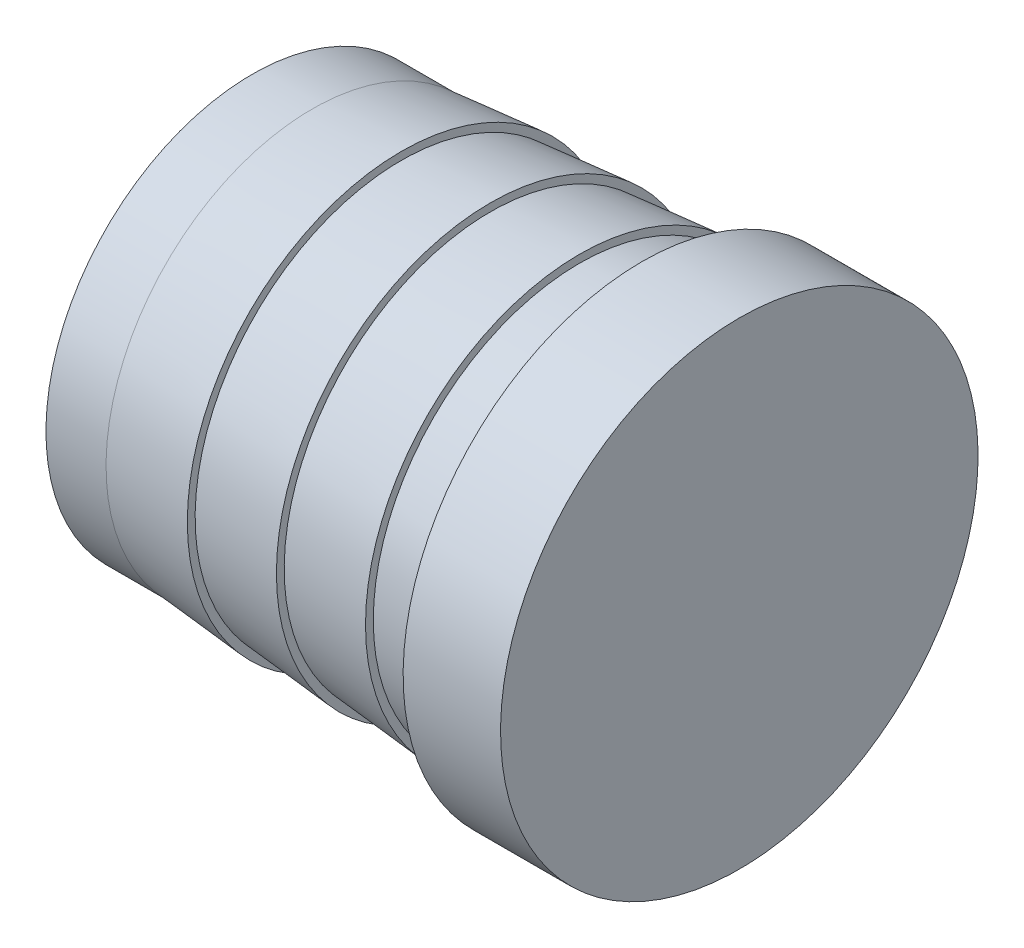
ISO-10303-21;
HEADER;
FILE_DESCRIPTION(('STEP AP214'),'2;1');
FILE_NAME('part.step','',(''),(''),'','','');
FILE_SCHEMA(('AUTOMOTIVE_DESIGN { 1 0 10303 214 1 1 1 1 }'));
ENDSEC;
DATA;
#1=APPLICATION_CONTEXT('core data for automotive mechanical design processes');
#2=APPLICATION_PROTOCOL_DEFINITION('international standard','automotive_design',2000,#1);
#3=PRODUCT_CONTEXT('',#1,'mechanical');
#4=PRODUCT('Part','Part','',(#3));
#5=PRODUCT_RELATED_PRODUCT_CATEGORY('part','',(#4));
#6=PRODUCT_DEFINITION_FORMATION('','',#4);
#7=PRODUCT_DEFINITION_CONTEXT('part definition',#1,'design');
#8=PRODUCT_DEFINITION('design','',#6,#7);
#9=PRODUCT_DEFINITION_SHAPE('','',#8);
#10=(LENGTH_UNIT() NAMED_UNIT(*) SI_UNIT(.MILLI.,.METRE.));
#11=(NAMED_UNIT(*) PLANE_ANGLE_UNIT() SI_UNIT($,.RADIAN.));
#12=(NAMED_UNIT(*) SI_UNIT($,.STERADIAN.) SOLID_ANGLE_UNIT());
#13=UNCERTAINTY_MEASURE_WITH_UNIT(LENGTH_MEASURE(1.E-05),#10,'distance_accuracy_value','');
#14=(GEOMETRIC_REPRESENTATION_CONTEXT(3) GLOBAL_UNCERTAINTY_ASSIGNED_CONTEXT((#13)) GLOBAL_UNIT_ASSIGNED_CONTEXT((#10,
#11,#12)) REPRESENTATION_CONTEXT('',''));
#15=CARTESIAN_POINT('',(0.,0.,0.));
#16=DIRECTION('',(0.,0.,1.));
#17=DIRECTION('',(1.,0.,0.));
#18=AXIS2_PLACEMENT_3D('',#15,#16,#17);
#19=CARTESIAN_POINT('',(-6.91245058118334,0.,0.));
#20=DIRECTION('',(1.,0.,0.));
#21=DIRECTION('',(0.,1.,0.));
#22=AXIS2_PLACEMENT_3D('',#19,#20,#21);
#23=CONICAL_SURFACE('',#22,20.92325,0.087266462599717);
#24=CARTESIAN_POINT('',(-15.6221504358874,0.,0.));
#25=DIRECTION('',(-1.,0.,0.));
#26=DIRECTION('',(0.,-1.,0.));
#27=AXIS2_PLACEMENT_3D('',#24,#25,#26);
#28=CIRCLE('',#27,20.16125);
#29=CARTESIAN_POINT('',(-15.6221504358874,-20.16125,0.));
#30=VERTEX_POINT('',#29);
#31=EDGE_CURVE('E48',#30,#30,#28,.T.);
#32=ORIENTED_EDGE('',*,*,#31,.F.);
#33=EDGE_LOOP('',(#32));
#34=FACE_BOUND('',#33,.T.);
#35=CARTESIAN_POINT('',(-9.52499999999999,0.,0.));
#36=DIRECTION('',(1.,0.,0.));
#37=DIRECTION('',(0.,1.,0.));
#38=AXIS2_PLACEMENT_3D('',#35,#36,#37);
#39=CIRCLE('',#38,20.6946815429523);
#40=CARTESIAN_POINT('',(-9.525,20.6946815429523,0.));
#41=VERTEX_POINT('',#40);
#42=EDGE_CURVE('E10',#41,#41,#39,.T.);
#43=ORIENTED_EDGE('',*,*,#42,.F.);
#44=EDGE_LOOP('',(#43));
#45=FACE_BOUND('',#44,.T.);
#46=ADVANCED_FACE('F33',(#34,#45),#23,.T.);
#47=CARTESIAN_POINT('',(-47.625,20.16125,0.));
#48=DIRECTION('',(1.,0.,0.));
#49=DIRECTION('',(0.,1.,0.));
#50=AXIS2_PLACEMENT_3D('',#47,#48,#49);
#51=PLANE('',#50);
#52=CARTESIAN_POINT('',(-47.625,0.,0.));
#53=DIRECTION('',(-1.,0.,0.));
#54=DIRECTION('',(0.,-1.,0.));
#55=AXIS2_PLACEMENT_3D('',#52,#53,#54);
#56=CIRCLE('',#55,14.2875);
#57=CARTESIAN_POINT('',(-47.625,-14.2875,0.));
#58=VERTEX_POINT('',#57);
#59=EDGE_CURVE('E40',#58,#58,#56,.T.);
#60=ORIENTED_EDGE('',*,*,#59,.F.);
#61=EDGE_LOOP('',(#60));
#62=FACE_BOUND('',#61,.T.);
#63=CARTESIAN_POINT('',(-47.625,0.,0.));
#64=DIRECTION('',(-1.,0.,0.));
#65=DIRECTION('',(0.,-1.,0.));
#66=AXIS2_PLACEMENT_3D('',#63,#64,#65);
#67=CIRCLE('',#66,20.16125);
#68=CARTESIAN_POINT('',(-47.625,-20.16125,0.));
#69=VERTEX_POINT('',#68);
#70=EDGE_CURVE('E71',#69,#69,#67,.T.);
#71=ORIENTED_EDGE('',*,*,#70,.T.);
#72=EDGE_LOOP('',(#71));
#73=FACE_BOUND('',#72,.T.);
#74=ADVANCED_FACE('F35',(#62,#73),#51,.F.);
#75=CARTESIAN_POINT('',(-47.625,0.,0.));
#76=DIRECTION('',(-1.,0.,0.));
#77=DIRECTION('',(0.,-1.,0.));
#78=AXIS2_PLACEMENT_3D('',#75,#76,#77);
#79=CYLINDRICAL_SURFACE('',#78,14.2875);
#80=CARTESIAN_POINT('',(-9.52499999999999,0.,0.));
#81=DIRECTION('',(-1.,0.,0.));
#82=DIRECTION('',(0.,-1.,0.));
#83=AXIS2_PLACEMENT_3D('',#80,#81,#82);
#84=CIRCLE('',#83,14.2875);
#85=CARTESIAN_POINT('',(-9.52499999999999,-14.2875,0.));
#86=VERTEX_POINT('',#85);
#87=EDGE_CURVE('E44',#86,#86,#84,.T.);
#88=ORIENTED_EDGE('',*,*,#87,.F.);
#89=EDGE_LOOP('',(#88));
#90=FACE_BOUND('',#89,.T.);
#91=ORIENTED_EDGE('',*,*,#59,.T.);
#92=EDGE_LOOP('',(#91));
#93=FACE_BOUND('',#92,.T.);
#94=ADVANCED_FACE('F104',(#90,#93),#79,.F.);
#95=CARTESIAN_POINT('',(-15.6221504358874,20.92325,0.));
#96=DIRECTION('',(-1.,0.,0.));
#97=DIRECTION('',(0.,-1.,0.));
#98=AXIS2_PLACEMENT_3D('',#95,#96,#97);
#99=PLANE('',#98);
#100=CARTESIAN_POINT('',(-15.6221504358874,0.,0.));
#101=DIRECTION('',(-1.,0.,0.));
#102=DIRECTION('',(0.,-1.,0.));
#103=AXIS2_PLACEMENT_3D('',#100,#101,#102);
#104=CIRCLE('',#103,20.92325);
#105=CARTESIAN_POINT('',(-15.6221504358874,-20.92325,0.));
#106=VERTEX_POINT('',#105);
#107=EDGE_CURVE('E53',#106,#106,#104,.T.);
#108=ORIENTED_EDGE('',*,*,#107,.F.);
#109=EDGE_LOOP('',(#108));
#110=FACE_BOUND('',#109,.T.);
#111=ORIENTED_EDGE('',*,*,#31,.T.);
#112=EDGE_LOOP('',(#111));
#113=FACE_BOUND('',#112,.T.);
#114=ADVANCED_FACE('F109',(#110,#113),#99,.F.);
#115=CARTESIAN_POINT('',(-15.6221504358874,0.,0.));
#116=DIRECTION('',(1.,0.,0.));
#117=DIRECTION('',(0.,1.,0.));
#118=AXIS2_PLACEMENT_3D('',#115,#116,#117);
#119=CONICAL_SURFACE('',#118,20.92325,0.0872664625997163);
#120=CARTESIAN_POINT('',(-24.3318502905916,0.,0.));
#121=DIRECTION('',(-1.,0.,0.));
#122=DIRECTION('',(0.,-1.,0.));
#123=AXIS2_PLACEMENT_3D('',#120,#121,#122);
#124=CIRCLE('',#123,20.16125);
#125=CARTESIAN_POINT('',(-24.3318502905916,-20.16125,0.));
#126=VERTEX_POINT('',#125);
#127=EDGE_CURVE('E56',#126,#126,#124,.T.);
#128=ORIENTED_EDGE('',*,*,#127,.F.);
#129=EDGE_LOOP('',(#128));
#130=FACE_BOUND('',#129,.T.);
#131=ORIENTED_EDGE('',*,*,#107,.T.);
#132=EDGE_LOOP('',(#131));
#133=FACE_BOUND('',#132,.T.);
#134=ADVANCED_FACE('F116',(#130,#133),#119,.T.);
#135=CARTESIAN_POINT('',(-24.3318502905916,20.92325,0.));
#136=DIRECTION('',(-1.,0.,0.));
#137=DIRECTION('',(0.,-1.,0.));
#138=AXIS2_PLACEMENT_3D('',#135,#136,#137);
#139=PLANE('',#138);
#140=CARTESIAN_POINT('',(-24.3318502905916,0.,0.));
#141=DIRECTION('',(-1.,0.,0.));
#142=DIRECTION('',(0.,-1.,0.));
#143=AXIS2_PLACEMENT_3D('',#140,#141,#142);
#144=CIRCLE('',#143,20.92325);
#145=CARTESIAN_POINT('',(-24.3318502905916,-20.92325,0.));
#146=VERTEX_POINT('',#145);
#147=EDGE_CURVE('E59',#146,#146,#144,.T.);
#148=ORIENTED_EDGE('',*,*,#147,.F.);
#149=EDGE_LOOP('',(#148));
#150=FACE_BOUND('',#149,.T.);
#151=ORIENTED_EDGE('',*,*,#127,.T.);
#152=EDGE_LOOP('',(#151));
#153=FACE_BOUND('',#152,.T.);
#154=ADVANCED_FACE('F122',(#150,#153),#139,.F.);
#155=CARTESIAN_POINT('',(-24.3318502905916,0.,0.));
#156=DIRECTION('',(1.,0.,0.));
#157=DIRECTION('',(0.,1.,0.));
#158=AXIS2_PLACEMENT_3D('',#155,#156,#157);
#159=CONICAL_SURFACE('',#158,20.92325,0.0872664625997166);
#160=CARTESIAN_POINT('',(-33.0415501452958,0.,0.));
#161=DIRECTION('',(-1.,0.,0.));
#162=DIRECTION('',(0.,-1.,0.));
#163=AXIS2_PLACEMENT_3D('',#160,#161,#162);
#164=CIRCLE('',#163,20.16125);
#165=CARTESIAN_POINT('',(-33.0415501452958,-20.16125,0.));
#166=VERTEX_POINT('',#165);
#167=EDGE_CURVE('E62',#166,#166,#164,.T.);
#168=ORIENTED_EDGE('',*,*,#167,.F.);
#169=EDGE_LOOP('',(#168));
#170=FACE_BOUND('',#169,.T.);
#171=ORIENTED_EDGE('',*,*,#147,.T.);
#172=EDGE_LOOP('',(#171));
#173=FACE_BOUND('',#172,.T.);
#174=ADVANCED_FACE('F130',(#170,#173),#159,.T.);
#175=CARTESIAN_POINT('',(-33.0415501452958,20.92325,0.));
#176=DIRECTION('',(-1.,0.,0.));
#177=DIRECTION('',(0.,-1.,0.));
#178=AXIS2_PLACEMENT_3D('',#175,#176,#177);
#179=PLANE('',#178);
#180=CARTESIAN_POINT('',(-33.0415501452958,0.,0.));
#181=DIRECTION('',(-1.,0.,0.));
#182=DIRECTION('',(0.,-1.,0.));
#183=AXIS2_PLACEMENT_3D('',#180,#181,#182);
#184=CIRCLE('',#183,20.92325);
#185=CARTESIAN_POINT('',(-33.0415501452958,-20.92325,0.));
#186=VERTEX_POINT('',#185);
#187=EDGE_CURVE('E65',#186,#186,#184,.T.);
#188=ORIENTED_EDGE('',*,*,#187,.F.);
#189=EDGE_LOOP('',(#188));
#190=FACE_BOUND('',#189,.T.);
#191=ORIENTED_EDGE('',*,*,#167,.T.);
#192=EDGE_LOOP('',(#191));
#193=FACE_BOUND('',#192,.T.);
#194=ADVANCED_FACE('F137',(#190,#193),#179,.F.);
#195=CARTESIAN_POINT('',(-33.0415501452958,0.,0.));
#196=DIRECTION('',(1.,0.,0.));
#197=DIRECTION('',(0.,1.,0.));
#198=AXIS2_PLACEMENT_3D('',#195,#196,#197);
#199=CONICAL_SURFACE('',#198,20.92325,0.0872664625997165);
#200=CARTESIAN_POINT('',(-41.75125,0.,0.));
#201=DIRECTION('',(-1.,0.,0.));
#202=DIRECTION('',(0.,-1.,0.));
#203=AXIS2_PLACEMENT_3D('',#200,#201,#202);
#204=CIRCLE('',#203,20.16125);
#205=CARTESIAN_POINT('',(-41.75125,-20.16125,0.));
#206=VERTEX_POINT('',#205);
#207=EDGE_CURVE('E68',#206,#206,#204,.T.);
#208=ORIENTED_EDGE('',*,*,#207,.F.);
#209=EDGE_LOOP('',(#208));
#210=FACE_BOUND('',#209,.T.);
#211=ORIENTED_EDGE('',*,*,#187,.T.);
#212=EDGE_LOOP('',(#211));
#213=FACE_BOUND('',#212,.T.);
#214=ADVANCED_FACE('F141',(#210,#213),#199,.T.);
#215=CARTESIAN_POINT('',(-47.625,0.,0.));
#216=DIRECTION('',(-1.,0.,0.));
#217=DIRECTION('',(0.,-1.,0.));
#218=AXIS2_PLACEMENT_3D('',#215,#216,#217);
#219=CYLINDRICAL_SURFACE('',#218,20.16125);
#220=ORIENTED_EDGE('',*,*,#70,.F.);
#221=EDGE_LOOP('',(#220));
#222=FACE_BOUND('',#221,.T.);
#223=ORIENTED_EDGE('',*,*,#207,.T.);
#224=EDGE_LOOP('',(#223));
#225=FACE_BOUND('',#224,.T.);
#226=ADVANCED_FACE('F145',(#222,#225),#219,.T.);
#227=CARTESIAN_POINT('',(0.,0.,0.));
#228=DIRECTION('',(1.,0.,0.));
#229=DIRECTION('',(0.,1.,0.));
#230=AXIS2_PLACEMENT_3D('',#227,#228,#229);
#231=PLANE('',#230);
#232=CARTESIAN_POINT('',(0.,0.,0.));
#233=DIRECTION('',(1.,0.,0.));
#234=DIRECTION('',(0.,1.,0.));
#235=AXIS2_PLACEMENT_3D('',#232,#233,#234);
#236=CIRCLE('',#235,23.3426);
#237=CARTESIAN_POINT('',(0.,23.3426,0.));
#238=VERTEX_POINT('',#237);
#239=EDGE_CURVE('E74',#238,#238,#236,.T.);
#240=ORIENTED_EDGE('',*,*,#239,.T.);
#241=EDGE_LOOP('',(#240));
#242=FACE_BOUND('',#241,.T.);
#243=ADVANCED_FACE('F81',(#242),#231,.T.);
#244=CARTESIAN_POINT('',(0.,0.,0.));
#245=DIRECTION('',(-1.,0.,0.));
#246=DIRECTION('',(0.,-1.,0.));
#247=AXIS2_PLACEMENT_3D('',#244,#245,#246);
#248=CYLINDRICAL_SURFACE('',#247,23.3426);
#249=ORIENTED_EDGE('',*,*,#239,.F.);
#250=EDGE_LOOP('',(#249));
#251=FACE_BOUND('',#250,.T.);
#252=CARTESIAN_POINT('',(-9.52499999999999,0.,0.));
#253=DIRECTION('',(1.,0.,0.));
#254=DIRECTION('',(0.,1.,0.));
#255=AXIS2_PLACEMENT_3D('',#252,#253,#254);
#256=CIRCLE('',#255,23.3426);
#257=CARTESIAN_POINT('',(-9.525,23.3426,0.));
#258=VERTEX_POINT('',#257);
#259=EDGE_CURVE('E75',#258,#258,#256,.T.);
#260=ORIENTED_EDGE('',*,*,#259,.T.);
#261=EDGE_LOOP('',(#260));
#262=FACE_BOUND('',#261,.T.);
#263=ADVANCED_FACE('F83',(#251,#262),#248,.T.);
#264=CARTESIAN_POINT('',(-9.52499999999999,0.,0.));
#265=DIRECTION('',(1.,0.,0.));
#266=DIRECTION('',(0.,1.,0.));
#267=AXIS2_PLACEMENT_3D('',#264,#265,#266);
#268=PLANE('',#267);
#269=ORIENTED_EDGE('',*,*,#259,.F.);
#270=EDGE_LOOP('',(#269));
#271=FACE_BOUND('',#270,.T.);
#272=ORIENTED_EDGE('',*,*,#42,.T.);
#273=EDGE_LOOP('',(#272));
#274=FACE_BOUND('',#273,.T.);
#275=ADVANCED_FACE('F86',(#271,#274),#268,.F.);
#276=ORIENTED_EDGE('',*,*,#87,.T.);
#277=EDGE_LOOP('',(#276));
#278=FACE_BOUND('',#277,.T.);
#279=ADVANCED_FACE('F91',(#278),#268,.F.);
#280=CLOSED_SHELL('',(#46,#74,#94,#114,#134,#154,#174,#194,#214,#226,#243,#263,#275,#279));
#281=MANIFOLD_SOLID_BREP('B2',#280);
#282=ADVANCED_BREP_SHAPE_REPRESENTATION('',(#18,#281),#14);
#283=SHAPE_DEFINITION_REPRESENTATION(#9,#282);
ENDSEC;
END-ISO-10303-21;
